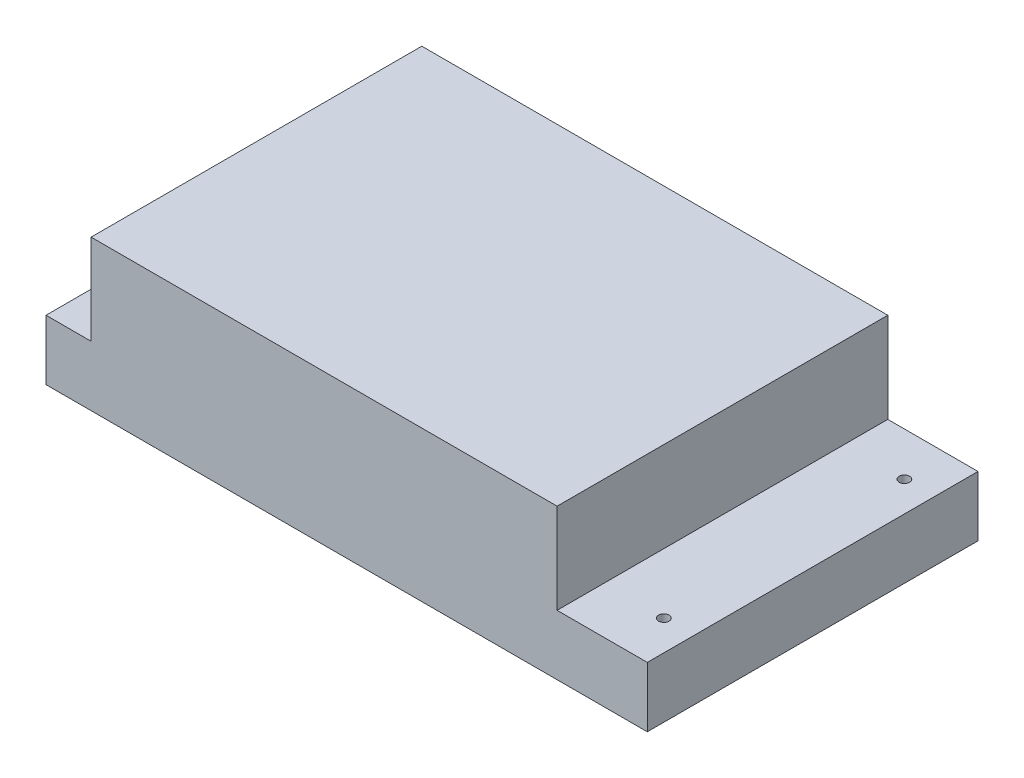
ISO-10303-21;
HEADER;
FILE_DESCRIPTION(('STEP AP214'),'2;1');
FILE_NAME('part.step','',(''),(''),'','','');
FILE_SCHEMA(('AUTOMOTIVE_DESIGN { 1 0 10303 214 1 1 1 1 }'));
ENDSEC;
DATA;
#1=APPLICATION_CONTEXT('core data for automotive mechanical design processes');
#2=APPLICATION_PROTOCOL_DEFINITION('international standard','automotive_design',2000,#1);
#3=PRODUCT_CONTEXT('',#1,'mechanical');
#4=PRODUCT('Part','Part','',(#3));
#5=PRODUCT_RELATED_PRODUCT_CATEGORY('part','',(#4));
#6=PRODUCT_DEFINITION_FORMATION('','',#4);
#7=PRODUCT_DEFINITION_CONTEXT('part definition',#1,'design');
#8=PRODUCT_DEFINITION('design','',#6,#7);
#9=PRODUCT_DEFINITION_SHAPE('','',#8);
#10=(LENGTH_UNIT() NAMED_UNIT(*) SI_UNIT(.MILLI.,.METRE.));
#11=(NAMED_UNIT(*) PLANE_ANGLE_UNIT() SI_UNIT($,.RADIAN.));
#12=(NAMED_UNIT(*) SI_UNIT($,.STERADIAN.) SOLID_ANGLE_UNIT());
#13=UNCERTAINTY_MEASURE_WITH_UNIT(LENGTH_MEASURE(1.E-05),#10,'distance_accuracy_value','');
#14=(GEOMETRIC_REPRESENTATION_CONTEXT(3) GLOBAL_UNCERTAINTY_ASSIGNED_CONTEXT((#13)) GLOBAL_UNIT_ASSIGNED_CONTEXT((#10,
#11,#12)) REPRESENTATION_CONTEXT('',''));
#15=CARTESIAN_POINT('',(0.,0.,0.));
#16=DIRECTION('',(0.,0.,1.));
#17=DIRECTION('',(1.,0.,0.));
#18=AXIS2_PLACEMENT_3D('',#15,#16,#17);
#19=CARTESIAN_POINT('',(0.,50.,0.));
#20=DIRECTION('',(1.,0.,0.));
#21=DIRECTION('',(0.,0.,-1.));
#22=AXIS2_PLACEMENT_3D('',#19,#20,#21);
#23=PLANE('',#22);
#24=DIRECTION('',(0.,0.,1.));
#25=VECTOR('',#24,1.);
#26=CARTESIAN_POINT('',(0.,20.,-110.));
#27=LINE('',#26,#25);
#28=CARTESIAN_POINT('',(0.,20.,-110.));
#29=VERTEX_POINT('',#28);
#30=CARTESIAN_POINT('',(0.,20.,0.));
#31=VERTEX_POINT('',#30);
#32=EDGE_CURVE('E152',#29,#31,#27,.T.);
#33=ORIENTED_EDGE('',*,*,#32,.F.);
#34=DIRECTION('',(0.,-1.,0.));
#35=VECTOR('',#34,1.);
#36=CARTESIAN_POINT('',(0.,50.,-110.));
#37=LINE('',#36,#35);
#38=CARTESIAN_POINT('',(0.,0.,-110.));
#39=VERTEX_POINT('',#38);
#40=EDGE_CURVE('E125',#29,#39,#37,.T.);
#41=ORIENTED_EDGE('',*,*,#40,.T.);
#42=DIRECTION('',(0.,0.,1.));
#43=VECTOR('',#42,1.);
#44=CARTESIAN_POINT('',(0.,0.,0.));
#45=LINE('',#44,#43);
#46=CARTESIAN_POINT('',(0.,0.,0.));
#47=VERTEX_POINT('',#46);
#48=EDGE_CURVE('E137',#39,#47,#45,.T.);
#49=ORIENTED_EDGE('',*,*,#48,.T.);
#50=DIRECTION('',(0.,-1.,0.));
#51=VECTOR('',#50,1.);
#52=CARTESIAN_POINT('',(0.,50.,0.));
#53=LINE('',#52,#51);
#54=EDGE_CURVE('E11',#31,#47,#53,.T.);
#55=ORIENTED_EDGE('',*,*,#54,.F.);
#56=EDGE_LOOP('',(#33,#41,#49,#55));
#57=FACE_BOUND('',#56,.T.);
#58=ADVANCED_FACE('F38',(#57),#23,.F.);
#59=CARTESIAN_POINT('',(0.,50.,0.));
#60=DIRECTION('',(0.,0.,-1.));
#61=DIRECTION('',(-1.,0.,0.));
#62=AXIS2_PLACEMENT_3D('',#59,#60,#61);
#63=PLANE('',#62);
#64=DIRECTION('',(1.,0.,0.));
#65=VECTOR('',#64,1.);
#66=CARTESIAN_POINT('',(200.,20.,0.));
#67=LINE('',#66,#65);
#68=CARTESIAN_POINT('',(170.,20.,0.));
#69=VERTEX_POINT('',#68);
#70=CARTESIAN_POINT('',(200.,20.,0.));
#71=VERTEX_POINT('',#70);
#72=EDGE_CURVE('E107',#69,#71,#67,.T.);
#73=ORIENTED_EDGE('',*,*,#72,.F.);
#74=DIRECTION('',(0.,1.,0.));
#75=VECTOR('',#74,1.);
#76=CARTESIAN_POINT('',(170.,20.,0.));
#77=LINE('',#76,#75);
#78=CARTESIAN_POINT('',(170.,50.,0.));
#79=VERTEX_POINT('',#78);
#80=EDGE_CURVE('E140',#69,#79,#77,.T.);
#81=ORIENTED_EDGE('',*,*,#80,.T.);
#82=DIRECTION('',(1.,0.,0.));
#83=VECTOR('',#82,1.);
#84=CARTESIAN_POINT('',(0.,50.,0.));
#85=LINE('',#84,#83);
#86=CARTESIAN_POINT('',(15.,50.,0.));
#87=VERTEX_POINT('',#86);
#88=EDGE_CURVE('E132',#87,#79,#85,.T.);
#89=ORIENTED_EDGE('',*,*,#88,.F.);
#90=DIRECTION('',(0.,1.,0.));
#91=VECTOR('',#90,1.);
#92=CARTESIAN_POINT('',(15.,20.,0.));
#93=LINE('',#92,#91);
#94=CARTESIAN_POINT('',(15.,20.,0.));
#95=VERTEX_POINT('',#94);
#96=EDGE_CURVE('E60',#95,#87,#93,.T.);
#97=ORIENTED_EDGE('',*,*,#96,.F.);
#98=DIRECTION('',(1.,0.,0.));
#99=VECTOR('',#98,1.);
#100=CARTESIAN_POINT('',(0.,20.,0.));
#101=LINE('',#100,#99);
#102=EDGE_CURVE('E158',#31,#95,#101,.T.);
#103=ORIENTED_EDGE('',*,*,#102,.F.);
#104=ORIENTED_EDGE('',*,*,#54,.T.);
#105=DIRECTION('',(1.,0.,0.));
#106=VECTOR('',#105,1.);
#107=CARTESIAN_POINT('',(0.,0.,0.));
#108=LINE('',#107,#106);
#109=CARTESIAN_POINT('',(200.,0.,0.));
#110=VERTEX_POINT('',#109);
#111=EDGE_CURVE('E134',#47,#110,#108,.T.);
#112=ORIENTED_EDGE('',*,*,#111,.T.);
#113=DIRECTION('',(0.,-1.,0.));
#114=VECTOR('',#113,1.);
#115=CARTESIAN_POINT('',(200.,50.,0.));
#116=LINE('',#115,#114);
#117=EDGE_CURVE('E45',#71,#110,#116,.T.);
#118=ORIENTED_EDGE('',*,*,#117,.F.);
#119=EDGE_LOOP('',(#73,#81,#89,#97,#103,#104,#112,#118));
#120=FACE_BOUND('',#119,.T.);
#121=ADVANCED_FACE('F208',(#120),#63,.F.);
#122=CARTESIAN_POINT('',(200.,50.,0.));
#123=DIRECTION('',(-1.,0.,0.));
#124=DIRECTION('',(0.,0.,1.));
#125=AXIS2_PLACEMENT_3D('',#122,#123,#124);
#126=PLANE('',#125);
#127=DIRECTION('',(0.,-1.,0.));
#128=VECTOR('',#127,1.);
#129=CARTESIAN_POINT('',(200.,50.,-110.));
#130=LINE('',#129,#128);
#131=CARTESIAN_POINT('',(200.,20.,-110.));
#132=VERTEX_POINT('',#131);
#133=CARTESIAN_POINT('',(200.,0.,-110.));
#134=VERTEX_POINT('',#133);
#135=EDGE_CURVE('E117',#132,#134,#130,.T.);
#136=ORIENTED_EDGE('',*,*,#135,.F.);
#137=DIRECTION('',(0.,0.,-1.));
#138=VECTOR('',#137,1.);
#139=CARTESIAN_POINT('',(200.,20.,-110.));
#140=LINE('',#139,#138);
#141=EDGE_CURVE('E101',#71,#132,#140,.T.);
#142=ORIENTED_EDGE('',*,*,#141,.F.);
#143=ORIENTED_EDGE('',*,*,#117,.T.);
#144=DIRECTION('',(0.,0.,-1.));
#145=VECTOR('',#144,1.);
#146=CARTESIAN_POINT('',(200.,0.,0.));
#147=LINE('',#146,#145);
#148=EDGE_CURVE('E123',#110,#134,#147,.T.);
#149=ORIENTED_EDGE('',*,*,#148,.T.);
#150=EDGE_LOOP('',(#136,#142,#143,#149));
#151=FACE_BOUND('',#150,.T.);
#152=ADVANCED_FACE('F121',(#151),#126,.F.);
#153=CARTESIAN_POINT('',(0.,50.,-110.));
#154=DIRECTION('',(0.,0.,1.));
#155=DIRECTION('',(1.,0.,0.));
#156=AXIS2_PLACEMENT_3D('',#153,#154,#155);
#157=PLANE('',#156);
#158=DIRECTION('',(-1.,0.,0.));
#159=VECTOR('',#158,1.);
#160=CARTESIAN_POINT('',(0.,50.,-110.));
#161=LINE('',#160,#159);
#162=CARTESIAN_POINT('',(170.,50.,-110.));
#163=VERTEX_POINT('',#162);
#164=CARTESIAN_POINT('',(15.,50.,-110.));
#165=VERTEX_POINT('',#164);
#166=EDGE_CURVE('E127',#163,#165,#161,.T.);
#167=ORIENTED_EDGE('',*,*,#166,.F.);
#168=DIRECTION('',(0.,1.,0.));
#169=VECTOR('',#168,1.);
#170=CARTESIAN_POINT('',(170.,20.,-110.));
#171=LINE('',#170,#169);
#172=CARTESIAN_POINT('',(170.,20.,-110.));
#173=VERTEX_POINT('',#172);
#174=EDGE_CURVE('E52',#173,#163,#171,.T.);
#175=ORIENTED_EDGE('',*,*,#174,.F.);
#176=DIRECTION('',(-1.,0.,0.));
#177=VECTOR('',#176,1.);
#178=CARTESIAN_POINT('',(200.,20.,-110.));
#179=LINE('',#178,#177);
#180=EDGE_CURVE('E105',#132,#173,#179,.T.);
#181=ORIENTED_EDGE('',*,*,#180,.F.);
#182=ORIENTED_EDGE('',*,*,#135,.T.);
#183=DIRECTION('',(-1.,0.,0.));
#184=VECTOR('',#183,1.);
#185=CARTESIAN_POINT('',(0.,0.,-110.));
#186=LINE('',#185,#184);
#187=EDGE_CURVE('E130',#134,#39,#186,.T.);
#188=ORIENTED_EDGE('',*,*,#187,.T.);
#189=ORIENTED_EDGE('',*,*,#40,.F.);
#190=DIRECTION('',(-1.,0.,0.));
#191=VECTOR('',#190,1.);
#192=CARTESIAN_POINT('',(0.,20.,-110.));
#193=LINE('',#192,#191);
#194=CARTESIAN_POINT('',(15.,20.,-110.));
#195=VERTEX_POINT('',#194);
#196=EDGE_CURVE('E147',#195,#29,#193,.T.);
#197=ORIENTED_EDGE('',*,*,#196,.F.);
#198=DIRECTION('',(0.,1.,0.));
#199=VECTOR('',#198,1.);
#200=CARTESIAN_POINT('',(15.,20.,-110.));
#201=LINE('',#200,#199);
#202=EDGE_CURVE('E146',#195,#165,#201,.T.);
#203=ORIENTED_EDGE('',*,*,#202,.T.);
#204=EDGE_LOOP('',(#167,#175,#181,#182,#188,#189,#197,#203));
#205=FACE_BOUND('',#204,.T.);
#206=ADVANCED_FACE('F115',(#205),#157,.F.);
#207=CARTESIAN_POINT('',(0.,50.,0.));
#208=DIRECTION('',(0.,-1.,0.));
#209=DIRECTION('',(0.,0.,-1.));
#210=AXIS2_PLACEMENT_3D('',#207,#208,#209);
#211=PLANE('',#210);
#212=ORIENTED_EDGE('',*,*,#88,.T.);
#213=DIRECTION('',(0.,0.,1.));
#214=VECTOR('',#213,1.);
#215=CARTESIAN_POINT('',(170.,50.,-110.));
#216=LINE('',#215,#214);
#217=EDGE_CURVE('E111',#163,#79,#216,.T.);
#218=ORIENTED_EDGE('',*,*,#217,.F.);
#219=ORIENTED_EDGE('',*,*,#166,.T.);
#220=DIRECTION('',(0.,0.,-1.));
#221=VECTOR('',#220,1.);
#222=CARTESIAN_POINT('',(15.,50.,-110.));
#223=LINE('',#222,#221);
#224=EDGE_CURVE('E150',#87,#165,#223,.T.);
#225=ORIENTED_EDGE('',*,*,#224,.F.);
#226=EDGE_LOOP('',(#212,#218,#219,#225));
#227=FACE_BOUND('',#226,.T.);
#228=ADVANCED_FACE('F215',(#227),#211,.F.);
#229=CARTESIAN_POINT('',(0.,0.,0.));
#230=DIRECTION('',(0.,-1.,0.));
#231=DIRECTION('',(0.,0.,-1.));
#232=AXIS2_PLACEMENT_3D('',#229,#230,#231);
#233=PLANE('',#232);
#234=CARTESIAN_POINT('',(190.,0.,-15.5));
#235=DIRECTION('',(0.,-1.,0.));
#236=DIRECTION('',(0.,0.,-1.));
#237=AXIS2_PLACEMENT_3D('',#234,#235,#236);
#238=CIRCLE('',#237,1.75000000000001);
#239=CARTESIAN_POINT('',(190.,0.,-17.25));
#240=VERTEX_POINT('',#239);
#241=EDGE_CURVE('E173',#240,#240,#238,.T.);
#242=ORIENTED_EDGE('',*,*,#241,.F.);
#243=EDGE_LOOP('',(#242));
#244=FACE_BOUND('',#243,.T.);
#245=CARTESIAN_POINT('',(10.,0.,-95.5));
#246=DIRECTION('',(0.,-1.,0.));
#247=DIRECTION('',(0.,0.,-1.));
#248=AXIS2_PLACEMENT_3D('',#245,#246,#247);
#249=CIRCLE('',#248,1.75000000000001);
#250=CARTESIAN_POINT('',(10.,0.,-97.25));
#251=VERTEX_POINT('',#250);
#252=EDGE_CURVE('E153',#251,#251,#249,.T.);
#253=ORIENTED_EDGE('',*,*,#252,.F.);
#254=EDGE_LOOP('',(#253));
#255=FACE_BOUND('',#254,.T.);
#256=CARTESIAN_POINT('',(10.,0.,-15.5));
#257=DIRECTION('',(0.,-1.,0.));
#258=DIRECTION('',(0.,0.,-1.));
#259=AXIS2_PLACEMENT_3D('',#256,#257,#258);
#260=CIRCLE('',#259,1.75000000000001);
#261=CARTESIAN_POINT('',(10.,0.,-17.25));
#262=VERTEX_POINT('',#261);
#263=EDGE_CURVE('E170',#262,#262,#260,.T.);
#264=ORIENTED_EDGE('',*,*,#263,.F.);
#265=EDGE_LOOP('',(#264));
#266=FACE_BOUND('',#265,.T.);
#267=CARTESIAN_POINT('',(190.,0.,-95.5));
#268=DIRECTION('',(0.,-1.,0.));
#269=DIRECTION('',(0.,0.,-1.));
#270=AXIS2_PLACEMENT_3D('',#267,#268,#269);
#271=CIRCLE('',#270,1.75000000000001);
#272=CARTESIAN_POINT('',(190.,0.,-97.25));
#273=VERTEX_POINT('',#272);
#274=EDGE_CURVE('E176',#273,#273,#271,.T.);
#275=ORIENTED_EDGE('',*,*,#274,.F.);
#276=EDGE_LOOP('',(#275));
#277=FACE_BOUND('',#276,.T.);
#278=ORIENTED_EDGE('',*,*,#48,.F.);
#279=ORIENTED_EDGE('',*,*,#187,.F.);
#280=ORIENTED_EDGE('',*,*,#148,.F.);
#281=ORIENTED_EDGE('',*,*,#111,.F.);
#282=EDGE_LOOP('',(#278,#279,#280,#281));
#283=FACE_BOUND('',#282,.T.);
#284=ADVANCED_FACE('F213',(#244,#255,#266,#277,#283),#233,.T.);
#285=CARTESIAN_POINT('',(15.,20.,-110.));
#286=DIRECTION('',(1.,0.,0.));
#287=DIRECTION('',(0.,0.,-1.));
#288=AXIS2_PLACEMENT_3D('',#285,#286,#287);
#289=PLANE('',#288);
#290=ORIENTED_EDGE('',*,*,#224,.T.);
#291=ORIENTED_EDGE('',*,*,#202,.F.);
#292=DIRECTION('',(0.,0.,-1.));
#293=VECTOR('',#292,1.);
#294=CARTESIAN_POINT('',(15.,20.,-110.));
#295=LINE('',#294,#293);
#296=EDGE_CURVE('E155',#95,#195,#295,.T.);
#297=ORIENTED_EDGE('',*,*,#296,.F.);
#298=ORIENTED_EDGE('',*,*,#96,.T.);
#299=EDGE_LOOP('',(#290,#291,#297,#298));
#300=FACE_BOUND('',#299,.T.);
#301=ADVANCED_FACE('F198',(#300),#289,.F.);
#302=CARTESIAN_POINT('',(0.,20.,0.));
#303=DIRECTION('',(0.,1.,0.));
#304=DIRECTION('',(0.,0.,1.));
#305=AXIS2_PLACEMENT_3D('',#302,#303,#304);
#306=PLANE('',#305);
#307=CARTESIAN_POINT('',(10.,20.,-95.5));
#308=DIRECTION('',(0.,1.,0.));
#309=DIRECTION('',(0.,0.,1.));
#310=AXIS2_PLACEMENT_3D('',#307,#308,#309);
#311=CIRCLE('',#310,1.75000000000001);
#312=CARTESIAN_POINT('',(10.,20.,-93.75));
#313=VERTEX_POINT('',#312);
#314=EDGE_CURVE('E183',#313,#313,#311,.T.);
#315=ORIENTED_EDGE('',*,*,#314,.F.);
#316=EDGE_LOOP('',(#315));
#317=FACE_BOUND('',#316,.T.);
#318=CARTESIAN_POINT('',(10.,20.,-15.5));
#319=DIRECTION('',(0.,1.,0.));
#320=DIRECTION('',(0.,0.,1.));
#321=AXIS2_PLACEMENT_3D('',#318,#319,#320);
#322=CIRCLE('',#321,1.75000000000001);
#323=CARTESIAN_POINT('',(10.,20.,-13.75));
#324=VERTEX_POINT('',#323);
#325=EDGE_CURVE('E186',#324,#324,#322,.T.);
#326=ORIENTED_EDGE('',*,*,#325,.F.);
#327=EDGE_LOOP('',(#326));
#328=FACE_BOUND('',#327,.T.);
#329=ORIENTED_EDGE('',*,*,#32,.T.);
#330=ORIENTED_EDGE('',*,*,#102,.T.);
#331=ORIENTED_EDGE('',*,*,#296,.T.);
#332=ORIENTED_EDGE('',*,*,#196,.T.);
#333=EDGE_LOOP('',(#329,#330,#331,#332));
#334=FACE_BOUND('',#333,.T.);
#335=ADVANCED_FACE('F194',(#317,#328,#334),#306,.T.);
#336=CARTESIAN_POINT('',(170.,20.,-110.));
#337=DIRECTION('',(-1.,0.,0.));
#338=DIRECTION('',(0.,0.,1.));
#339=AXIS2_PLACEMENT_3D('',#336,#337,#338);
#340=PLANE('',#339);
#341=ORIENTED_EDGE('',*,*,#217,.T.);
#342=ORIENTED_EDGE('',*,*,#80,.F.);
#343=DIRECTION('',(0.,0.,1.));
#344=VECTOR('',#343,1.);
#345=CARTESIAN_POINT('',(170.,20.,-110.));
#346=LINE('',#345,#344);
#347=EDGE_CURVE('E119',#173,#69,#346,.T.);
#348=ORIENTED_EDGE('',*,*,#347,.F.);
#349=ORIENTED_EDGE('',*,*,#174,.T.);
#350=EDGE_LOOP('',(#341,#342,#348,#349));
#351=FACE_BOUND('',#350,.T.);
#352=ADVANCED_FACE('F197',(#351),#340,.F.);
#353=CARTESIAN_POINT('',(0.,20.,0.));
#354=DIRECTION('',(0.,-1.,0.));
#355=DIRECTION('',(0.,0.,-1.));
#356=AXIS2_PLACEMENT_3D('',#353,#354,#355);
#357=PLANE('',#356);
#358=CARTESIAN_POINT('',(190.,20.,-15.5));
#359=DIRECTION('',(0.,1.,0.));
#360=DIRECTION('',(0.,0.,1.));
#361=AXIS2_PLACEMENT_3D('',#358,#359,#360);
#362=CIRCLE('',#361,1.75000000000001);
#363=CARTESIAN_POINT('',(190.,20.,-13.75));
#364=VERTEX_POINT('',#363);
#365=EDGE_CURVE('E182',#364,#364,#362,.T.);
#366=ORIENTED_EDGE('',*,*,#365,.F.);
#367=EDGE_LOOP('',(#366));
#368=FACE_BOUND('',#367,.T.);
#369=CARTESIAN_POINT('',(190.,20.,-95.5));
#370=DIRECTION('',(0.,1.,0.));
#371=DIRECTION('',(0.,0.,1.));
#372=AXIS2_PLACEMENT_3D('',#369,#370,#371);
#373=CIRCLE('',#372,1.75000000000001);
#374=CARTESIAN_POINT('',(190.,20.,-93.75));
#375=VERTEX_POINT('',#374);
#376=EDGE_CURVE('E179',#375,#375,#373,.T.);
#377=ORIENTED_EDGE('',*,*,#376,.F.);
#378=EDGE_LOOP('',(#377));
#379=FACE_BOUND('',#378,.T.);
#380=ORIENTED_EDGE('',*,*,#141,.T.);
#381=ORIENTED_EDGE('',*,*,#180,.T.);
#382=ORIENTED_EDGE('',*,*,#347,.T.);
#383=ORIENTED_EDGE('',*,*,#72,.T.);
#384=EDGE_LOOP('',(#380,#381,#382,#383));
#385=FACE_BOUND('',#384,.T.);
#386=ADVANCED_FACE('F103',(#368,#379,#385),#357,.F.);
#387=CARTESIAN_POINT('',(190.,-9.99999999999999,-95.5));
#388=DIRECTION('',(0.,1.,0.));
#389=DIRECTION('',(0.,0.,1.));
#390=AXIS2_PLACEMENT_3D('',#387,#388,#389);
#391=CYLINDRICAL_SURFACE('',#390,1.75000000000001);
#392=ORIENTED_EDGE('',*,*,#274,.T.);
#393=EDGE_LOOP('',(#392));
#394=FACE_BOUND('',#393,.T.);
#395=ORIENTED_EDGE('',*,*,#376,.T.);
#396=EDGE_LOOP('',(#395));
#397=FACE_BOUND('',#396,.T.);
#398=ADVANCED_FACE('F264',(#394,#397),#391,.F.);
#399=CARTESIAN_POINT('',(190.,-9.99999999999999,-15.5));
#400=DIRECTION('',(0.,1.,0.));
#401=DIRECTION('',(0.,0.,1.));
#402=AXIS2_PLACEMENT_3D('',#399,#400,#401);
#403=CYLINDRICAL_SURFACE('',#402,1.75000000000001);
#404=ORIENTED_EDGE('',*,*,#241,.T.);
#405=EDGE_LOOP('',(#404));
#406=FACE_BOUND('',#405,.T.);
#407=ORIENTED_EDGE('',*,*,#365,.T.);
#408=EDGE_LOOP('',(#407));
#409=FACE_BOUND('',#408,.T.);
#410=ADVANCED_FACE('F274',(#406,#409),#403,.F.);
#411=CARTESIAN_POINT('',(10.,-9.99999999999999,-15.5));
#412=DIRECTION('',(0.,1.,0.));
#413=DIRECTION('',(0.,0.,1.));
#414=AXIS2_PLACEMENT_3D('',#411,#412,#413);
#415=CYLINDRICAL_SURFACE('',#414,1.75000000000001);
#416=ORIENTED_EDGE('',*,*,#263,.T.);
#417=EDGE_LOOP('',(#416));
#418=FACE_BOUND('',#417,.T.);
#419=ORIENTED_EDGE('',*,*,#325,.T.);
#420=EDGE_LOOP('',(#419));
#421=FACE_BOUND('',#420,.T.);
#422=ADVANCED_FACE('F192',(#418,#421),#415,.F.);
#423=CARTESIAN_POINT('',(10.,-9.99999999999999,-95.5));
#424=DIRECTION('',(0.,1.,0.));
#425=DIRECTION('',(0.,0.,1.));
#426=AXIS2_PLACEMENT_3D('',#423,#424,#425);
#427=CYLINDRICAL_SURFACE('',#426,1.75000000000001);
#428=ORIENTED_EDGE('',*,*,#252,.T.);
#429=EDGE_LOOP('',(#428));
#430=FACE_BOUND('',#429,.T.);
#431=ORIENTED_EDGE('',*,*,#314,.T.);
#432=EDGE_LOOP('',(#431));
#433=FACE_BOUND('',#432,.T.);
#434=ADVANCED_FACE('F293',(#430,#433),#427,.F.);
#435=CLOSED_SHELL('',(#58,#121,#152,#206,#228,#284,#301,#335,#352,#386,#398,#410,#422,#434));
#436=MANIFOLD_SOLID_BREP('B2',#435);
#437=ADVANCED_BREP_SHAPE_REPRESENTATION('',(#18,#436),#14);
#438=SHAPE_DEFINITION_REPRESENTATION(#9,#437);
ENDSEC;
END-ISO-10303-21;
